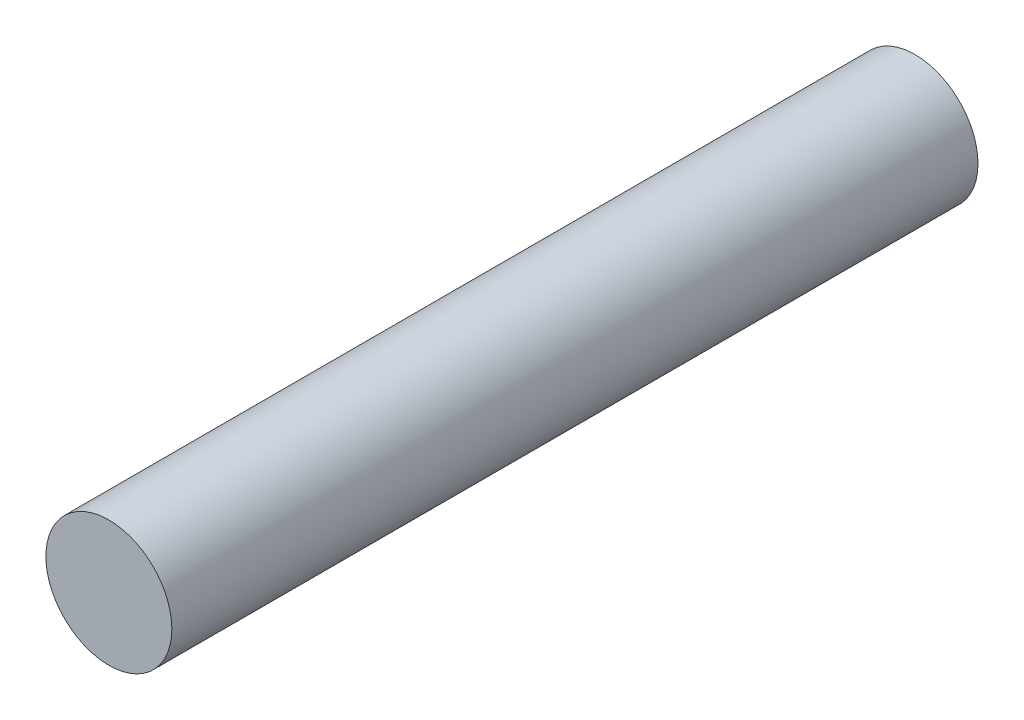
ISO-10303-21;
HEADER;
FILE_DESCRIPTION(('STEP AP214'),'2;1');
FILE_NAME('part.step','',(''),(''),'','','');
FILE_SCHEMA(('AUTOMOTIVE_DESIGN { 1 0 10303 214 1 1 1 1 }'));
ENDSEC;
DATA;
#1=APPLICATION_CONTEXT('core data for automotive mechanical design processes');
#2=APPLICATION_PROTOCOL_DEFINITION('international standard','automotive_design',2000,#1);
#3=PRODUCT_CONTEXT('',#1,'mechanical');
#4=PRODUCT('Part','Part','',(#3));
#5=PRODUCT_RELATED_PRODUCT_CATEGORY('part','',(#4));
#6=PRODUCT_DEFINITION_FORMATION('','',#4);
#7=PRODUCT_DEFINITION_CONTEXT('part definition',#1,'design');
#8=PRODUCT_DEFINITION('design','',#6,#7);
#9=PRODUCT_DEFINITION_SHAPE('','',#8);
#10=(LENGTH_UNIT() NAMED_UNIT(*) SI_UNIT(.MILLI.,.METRE.));
#11=(NAMED_UNIT(*) PLANE_ANGLE_UNIT() SI_UNIT($,.RADIAN.));
#12=(NAMED_UNIT(*) SI_UNIT($,.STERADIAN.) SOLID_ANGLE_UNIT());
#13=UNCERTAINTY_MEASURE_WITH_UNIT(LENGTH_MEASURE(1.E-05),#10,'distance_accuracy_value','');
#14=(GEOMETRIC_REPRESENTATION_CONTEXT(3) GLOBAL_UNCERTAINTY_ASSIGNED_CONTEXT((#13)) GLOBAL_UNIT_ASSIGNED_CONTEXT((#10,
#11,#12)) REPRESENTATION_CONTEXT('',''));
#15=CARTESIAN_POINT('',(0.,0.,0.));
#16=DIRECTION('',(0.,0.,1.));
#17=DIRECTION('',(1.,0.,0.));
#18=AXIS2_PLACEMENT_3D('',#15,#16,#17);
#19=CARTESIAN_POINT('',(0.,0.,25.4));
#20=DIRECTION('',(0.,0.,-1.));
#21=DIRECTION('',(-1.,0.,0.));
#22=AXIS2_PLACEMENT_3D('',#19,#20,#21);
#23=CYLINDRICAL_SURFACE('',#22,3.96875);
#24=CARTESIAN_POINT('',(0.,0.,25.4));
#25=DIRECTION('',(0.,0.,1.));
#26=DIRECTION('',(1.,0.,0.));
#27=AXIS2_PLACEMENT_3D('',#24,#25,#26);
#28=CIRCLE('',#27,3.96875);
#29=CARTESIAN_POINT('',(3.96875,0.,25.4));
#30=VERTEX_POINT('',#29);
#31=EDGE_CURVE('E10',#30,#30,#28,.T.);
#32=ORIENTED_EDGE('',*,*,#31,.F.);
#33=EDGE_LOOP('',(#32));
#34=FACE_BOUND('',#33,.T.);
#35=CARTESIAN_POINT('',(0.,0.,-25.4));
#36=DIRECTION('',(0.,0.,1.));
#37=DIRECTION('',(1.,0.,0.));
#38=AXIS2_PLACEMENT_3D('',#35,#36,#37);
#39=CIRCLE('',#38,3.96875);
#40=CARTESIAN_POINT('',(3.96875,0.,-25.4));
#41=VERTEX_POINT('',#40);
#42=EDGE_CURVE('E33',#41,#41,#39,.T.);
#43=ORIENTED_EDGE('',*,*,#42,.T.);
#44=EDGE_LOOP('',(#43));
#45=FACE_BOUND('',#44,.T.);
#46=ADVANCED_FACE('F30',(#34,#45),#23,.T.);
#47=CARTESIAN_POINT('',(0.,0.,25.4));
#48=DIRECTION('',(0.,0.,1.));
#49=DIRECTION('',(1.,0.,0.));
#50=AXIS2_PLACEMENT_3D('',#47,#48,#49);
#51=PLANE('',#50);
#52=ORIENTED_EDGE('',*,*,#31,.T.);
#53=EDGE_LOOP('',(#52));
#54=FACE_BOUND('',#53,.T.);
#55=ADVANCED_FACE('F45',(#54),#51,.T.);
#56=CARTESIAN_POINT('',(0.,0.,-25.4));
#57=DIRECTION('',(0.,0.,1.));
#58=DIRECTION('',(1.,0.,0.));
#59=AXIS2_PLACEMENT_3D('',#56,#57,#58);
#60=PLANE('',#59);
#61=ORIENTED_EDGE('',*,*,#42,.F.);
#62=EDGE_LOOP('',(#61));
#63=FACE_BOUND('',#62,.T.);
#64=ADVANCED_FACE('F43',(#63),#60,.F.);
#65=CLOSED_SHELL('',(#46,#55,#64));
#66=MANIFOLD_SOLID_BREP('B2',#65);
#67=ADVANCED_BREP_SHAPE_REPRESENTATION('',(#18,#66),#14);
#68=SHAPE_DEFINITION_REPRESENTATION(#9,#67);
ENDSEC;
END-ISO-10303-21;
